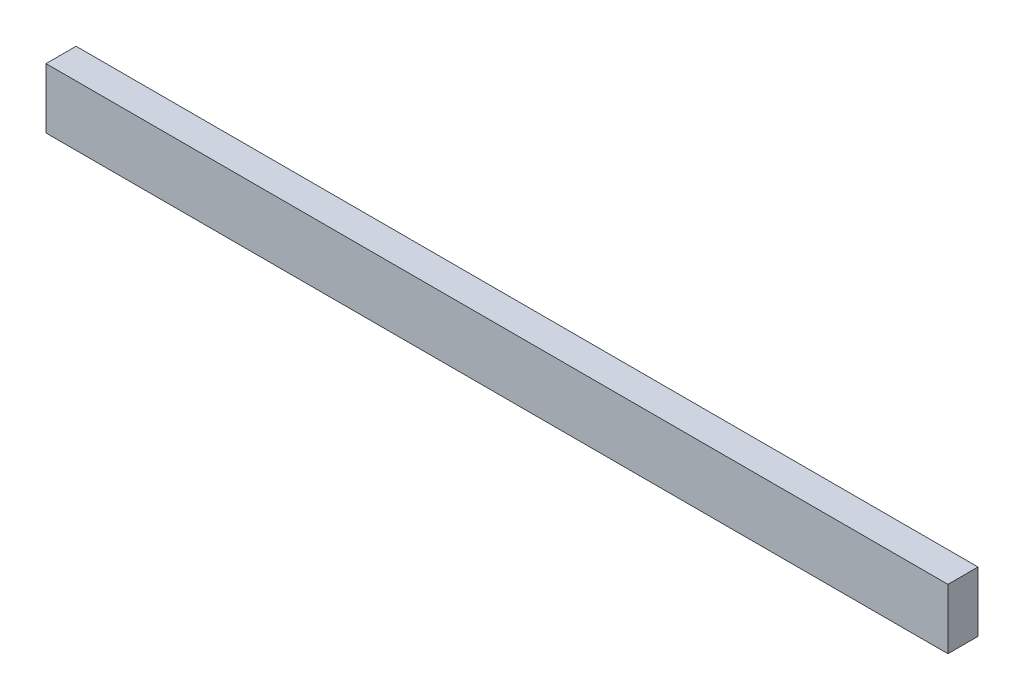
ISO-10303-21;
HEADER;
FILE_DESCRIPTION(('STEP AP214'),'2;1');
FILE_NAME('part.step','',(''),(''),'','','');
FILE_SCHEMA(('AUTOMOTIVE_DESIGN { 1 0 10303 214 1 1 1 1 }'));
ENDSEC;
DATA;
#1=APPLICATION_CONTEXT('core data for automotive mechanical design processes');
#2=APPLICATION_PROTOCOL_DEFINITION('international standard','automotive_design',2000,#1);
#3=PRODUCT_CONTEXT('',#1,'mechanical');
#4=PRODUCT('Part','Part','',(#3));
#5=PRODUCT_RELATED_PRODUCT_CATEGORY('part','',(#4));
#6=PRODUCT_DEFINITION_FORMATION('','',#4);
#7=PRODUCT_DEFINITION_CONTEXT('part definition',#1,'design');
#8=PRODUCT_DEFINITION('design','',#6,#7);
#9=PRODUCT_DEFINITION_SHAPE('','',#8);
#10=(LENGTH_UNIT() NAMED_UNIT(*) SI_UNIT(.MILLI.,.METRE.));
#11=(NAMED_UNIT(*) PLANE_ANGLE_UNIT() SI_UNIT($,.RADIAN.));
#12=(NAMED_UNIT(*) SI_UNIT($,.STERADIAN.) SOLID_ANGLE_UNIT());
#13=UNCERTAINTY_MEASURE_WITH_UNIT(LENGTH_MEASURE(1.E-05),#10,'distance_accuracy_value','');
#14=(GEOMETRIC_REPRESENTATION_CONTEXT(3) GLOBAL_UNCERTAINTY_ASSIGNED_CONTEXT((#13)) GLOBAL_UNIT_ASSIGNED_CONTEXT((#10,
#11,#12)) REPRESENTATION_CONTEXT('',''));
#15=CARTESIAN_POINT('',(0.,0.,0.));
#16=DIRECTION('',(0.,0.,1.));
#17=DIRECTION('',(1.,0.,0.));
#18=AXIS2_PLACEMENT_3D('',#15,#16,#17);
#19=CARTESIAN_POINT('',(15.,0.999999999999999,1.));
#20=DIRECTION('',(-1.,0.,0.));
#21=DIRECTION('',(0.,-1.,0.));
#22=AXIS2_PLACEMENT_3D('',#19,#20,#21);
#23=PLANE('',#22);
#24=DIRECTION('',(0.,1.,0.));
#25=VECTOR('',#24,1.);
#26=CARTESIAN_POINT('',(15.,0.999999999999999,0.));
#27=LINE('',#26,#25);
#28=CARTESIAN_POINT('',(15.,-1.,0.));
#29=VERTEX_POINT('',#28);
#30=CARTESIAN_POINT('',(15.,0.999999999999999,0.));
#31=VERTEX_POINT('',#30);
#32=EDGE_CURVE('E96',#29,#31,#27,.T.);
#33=ORIENTED_EDGE('',*,*,#32,.T.);
#34=DIRECTION('',(0.,0.,-1.));
#35=VECTOR('',#34,1.);
#36=CARTESIAN_POINT('',(15.,0.999999999999999,1.));
#37=LINE('',#36,#35);
#38=CARTESIAN_POINT('',(15.,0.999999999999999,1.));
#39=VERTEX_POINT('',#38);
#40=EDGE_CURVE('E11',#39,#31,#37,.T.);
#41=ORIENTED_EDGE('',*,*,#40,.F.);
#42=DIRECTION('',(0.,1.,0.));
#43=VECTOR('',#42,1.);
#44=CARTESIAN_POINT('',(15.,0.999999999999999,1.));
#45=LINE('',#44,#43);
#46=CARTESIAN_POINT('',(15.,-1.,1.));
#47=VERTEX_POINT('',#46);
#48=EDGE_CURVE('E84',#47,#39,#45,.T.);
#49=ORIENTED_EDGE('',*,*,#48,.F.);
#50=DIRECTION('',(0.,0.,-1.));
#51=VECTOR('',#50,1.);
#52=CARTESIAN_POINT('',(15.,-1.,1.));
#53=LINE('',#52,#51);
#54=EDGE_CURVE('E92',#47,#29,#53,.T.);
#55=ORIENTED_EDGE('',*,*,#54,.T.);
#56=EDGE_LOOP('',(#33,#41,#49,#55));
#57=FACE_BOUND('',#56,.T.);
#58=ADVANCED_FACE('F33',(#57),#23,.F.);
#59=CARTESIAN_POINT('',(-15.,0.999999999999999,1.));
#60=DIRECTION('',(0.,-1.,0.));
#61=DIRECTION('',(0.,0.,-1.));
#62=AXIS2_PLACEMENT_3D('',#59,#60,#61);
#63=PLANE('',#62);
#64=DIRECTION('',(-1.,0.,0.));
#65=VECTOR('',#64,1.);
#66=CARTESIAN_POINT('',(-15.,0.999999999999999,0.));
#67=LINE('',#66,#65);
#68=CARTESIAN_POINT('',(-15.,0.999999999999999,0.));
#69=VERTEX_POINT('',#68);
#70=EDGE_CURVE('E88',#31,#69,#67,.T.);
#71=ORIENTED_EDGE('',*,*,#70,.T.);
#72=DIRECTION('',(0.,0.,-1.));
#73=VECTOR('',#72,1.);
#74=CARTESIAN_POINT('',(-15.,0.999999999999999,1.));
#75=LINE('',#74,#73);
#76=CARTESIAN_POINT('',(-15.,0.999999999999999,1.));
#77=VERTEX_POINT('',#76);
#78=EDGE_CURVE('E41',#77,#69,#75,.T.);
#79=ORIENTED_EDGE('',*,*,#78,.F.);
#80=DIRECTION('',(-1.,0.,0.));
#81=VECTOR('',#80,1.);
#82=CARTESIAN_POINT('',(-15.,0.999999999999999,1.));
#83=LINE('',#82,#81);
#84=EDGE_CURVE('E79',#39,#77,#83,.T.);
#85=ORIENTED_EDGE('',*,*,#84,.F.);
#86=ORIENTED_EDGE('',*,*,#40,.T.);
#87=EDGE_LOOP('',(#71,#79,#85,#86));
#88=FACE_BOUND('',#87,.T.);
#89=ADVANCED_FACE('F87',(#88),#63,.F.);
#90=CARTESIAN_POINT('',(-15.,0.999999999999999,1.));
#91=DIRECTION('',(1.,0.,0.));
#92=DIRECTION('',(0.,0.,-1.));
#93=AXIS2_PLACEMENT_3D('',#90,#91,#92);
#94=PLANE('',#93);
#95=DIRECTION('',(0.,-1.,0.));
#96=VECTOR('',#95,1.);
#97=CARTESIAN_POINT('',(-15.,0.999999999999999,0.));
#98=LINE('',#97,#96);
#99=CARTESIAN_POINT('',(-15.,-1.,0.));
#100=VERTEX_POINT('',#99);
#101=EDGE_CURVE('E66',#69,#100,#98,.T.);
#102=ORIENTED_EDGE('',*,*,#101,.T.);
#103=DIRECTION('',(0.,0.,-1.));
#104=VECTOR('',#103,1.);
#105=CARTESIAN_POINT('',(-15.,-1.,1.));
#106=LINE('',#105,#104);
#107=CARTESIAN_POINT('',(-15.,-1.,1.));
#108=VERTEX_POINT('',#107);
#109=EDGE_CURVE('E89',#108,#100,#106,.T.);
#110=ORIENTED_EDGE('',*,*,#109,.F.);
#111=DIRECTION('',(0.,-1.,0.));
#112=VECTOR('',#111,1.);
#113=CARTESIAN_POINT('',(-15.,0.999999999999999,1.));
#114=LINE('',#113,#112);
#115=EDGE_CURVE('E82',#77,#108,#114,.T.);
#116=ORIENTED_EDGE('',*,*,#115,.F.);
#117=ORIENTED_EDGE('',*,*,#78,.T.);
#118=EDGE_LOOP('',(#102,#110,#116,#117));
#119=FACE_BOUND('',#118,.T.);
#120=ADVANCED_FACE('F90',(#119),#94,.F.);
#121=CARTESIAN_POINT('',(-15.,-1.,1.));
#122=DIRECTION('',(0.,1.,0.));
#123=DIRECTION('',(0.,0.,1.));
#124=AXIS2_PLACEMENT_3D('',#121,#122,#123);
#125=PLANE('',#124);
#126=DIRECTION('',(1.,0.,0.));
#127=VECTOR('',#126,1.);
#128=CARTESIAN_POINT('',(-15.,-1.,0.));
#129=LINE('',#128,#127);
#130=EDGE_CURVE('E72',#100,#29,#129,.T.);
#131=ORIENTED_EDGE('',*,*,#130,.T.);
#132=ORIENTED_EDGE('',*,*,#54,.F.);
#133=DIRECTION('',(1.,0.,0.));
#134=VECTOR('',#133,1.);
#135=CARTESIAN_POINT('',(-15.,-1.,1.));
#136=LINE('',#135,#134);
#137=EDGE_CURVE('E49',#108,#47,#136,.T.);
#138=ORIENTED_EDGE('',*,*,#137,.F.);
#139=ORIENTED_EDGE('',*,*,#109,.T.);
#140=EDGE_LOOP('',(#131,#132,#138,#139));
#141=FACE_BOUND('',#140,.T.);
#142=ADVANCED_FACE('F103',(#141),#125,.F.);
#143=CARTESIAN_POINT('',(0.,0.,1.));
#144=DIRECTION('',(0.,0.,1.));
#145=DIRECTION('',(1.,0.,0.));
#146=AXIS2_PLACEMENT_3D('',#143,#144,#145);
#147=PLANE('',#146);
#148=ORIENTED_EDGE('',*,*,#48,.T.);
#149=ORIENTED_EDGE('',*,*,#84,.T.);
#150=ORIENTED_EDGE('',*,*,#115,.T.);
#151=ORIENTED_EDGE('',*,*,#137,.T.);
#152=EDGE_LOOP('',(#148,#149,#150,#151));
#153=FACE_BOUND('',#152,.T.);
#154=ADVANCED_FACE('F80',(#153),#147,.T.);
#155=CARTESIAN_POINT('',(0.,0.,0.));
#156=DIRECTION('',(0.,0.,1.));
#157=DIRECTION('',(1.,0.,0.));
#158=AXIS2_PLACEMENT_3D('',#155,#156,#157);
#159=PLANE('',#158);
#160=ORIENTED_EDGE('',*,*,#32,.F.);
#161=ORIENTED_EDGE('',*,*,#130,.F.);
#162=ORIENTED_EDGE('',*,*,#101,.F.);
#163=ORIENTED_EDGE('',*,*,#70,.F.);
#164=EDGE_LOOP('',(#160,#161,#162,#163));
#165=FACE_BOUND('',#164,.T.);
#166=ADVANCED_FACE('F106',(#165),#159,.F.);
#167=CLOSED_SHELL('',(#58,#89,#120,#142,#154,#166));
#168=MANIFOLD_SOLID_BREP('B2',#167);
#169=ADVANCED_BREP_SHAPE_REPRESENTATION('',(#18,#168),#14);
#170=SHAPE_DEFINITION_REPRESENTATION(#9,#169);
ENDSEC;
END-ISO-10303-21;
